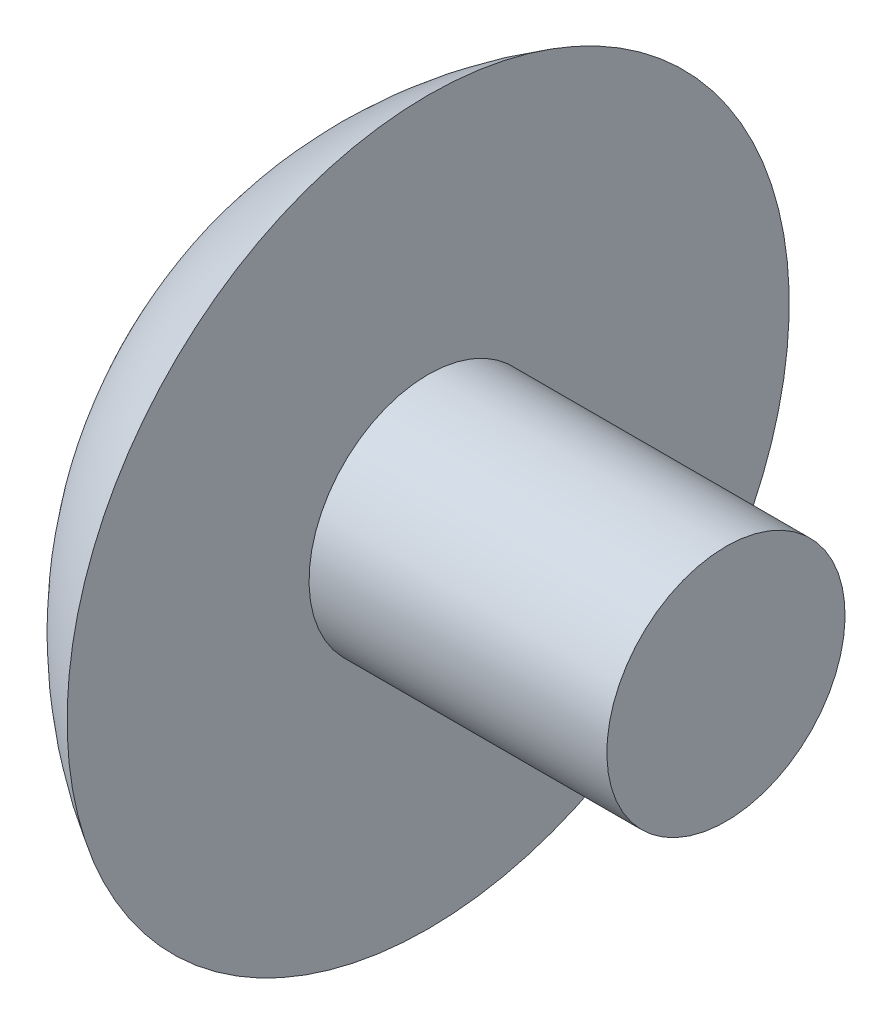
ISO-10303-21;
HEADER;
FILE_DESCRIPTION(('STEP AP214'),'2;1');
FILE_NAME('part.step','',(''),(''),'','','');
FILE_SCHEMA(('AUTOMOTIVE_DESIGN { 1 0 10303 214 1 1 1 1 }'));
ENDSEC;
DATA;
#1=APPLICATION_CONTEXT('core data for automotive mechanical design processes');
#2=APPLICATION_PROTOCOL_DEFINITION('international standard','automotive_design',2000,#1);
#3=PRODUCT_CONTEXT('',#1,'mechanical');
#4=PRODUCT('Part','Part','',(#3));
#5=PRODUCT_RELATED_PRODUCT_CATEGORY('part','',(#4));
#6=PRODUCT_DEFINITION_FORMATION('','',#4);
#7=PRODUCT_DEFINITION_CONTEXT('part definition',#1,'design');
#8=PRODUCT_DEFINITION('design','',#6,#7);
#9=PRODUCT_DEFINITION_SHAPE('','',#8);
#10=(LENGTH_UNIT() NAMED_UNIT(*) SI_UNIT(.MILLI.,.METRE.));
#11=(NAMED_UNIT(*) PLANE_ANGLE_UNIT() SI_UNIT($,.RADIAN.));
#12=(NAMED_UNIT(*) SI_UNIT($,.STERADIAN.) SOLID_ANGLE_UNIT());
#13=UNCERTAINTY_MEASURE_WITH_UNIT(LENGTH_MEASURE(1.E-05),#10,'distance_accuracy_value','');
#14=(GEOMETRIC_REPRESENTATION_CONTEXT(3) GLOBAL_UNCERTAINTY_ASSIGNED_CONTEXT((#13)) GLOBAL_UNIT_ASSIGNED_CONTEXT((#10,
#11,#12)) REPRESENTATION_CONTEXT('',''));
#15=CARTESIAN_POINT('',(0.,0.,0.));
#16=DIRECTION('',(0.,0.,1.));
#17=DIRECTION('',(1.,0.,0.));
#18=AXIS2_PLACEMENT_3D('',#15,#16,#17);
#19=CARTESIAN_POINT('',(0.,0.,0.));
#20=DIRECTION('',(-1.,0.,0.));
#21=DIRECTION('',(0.,-1.,0.));
#22=AXIS2_PLACEMENT_3D('',#19,#20,#21);
#23=PLANE('',#22);
#24=CARTESIAN_POINT('',(0.,0.,0.));
#25=DIRECTION('',(1.,0.,0.));
#26=DIRECTION('',(0.,1.,0.));
#27=AXIS2_PLACEMENT_3D('',#24,#25,#26);
#28=CIRCLE('',#27,2.);
#29=CARTESIAN_POINT('',(0.,2.,0.));
#30=VERTEX_POINT('',#29);
#31=EDGE_CURVE('E40',#30,#30,#28,.T.);
#32=ORIENTED_EDGE('',*,*,#31,.T.);
#33=EDGE_LOOP('',(#32));
#34=FACE_BOUND('',#33,.T.);
#35=ADVANCED_FACE('F30',(#34),#23,.F.);
#36=CARTESIAN_POINT('',(-1.5,0.,0.));
#37=DIRECTION('',(1.,0.,0.));
#38=DIRECTION('',(0.,-1.,0.));
#39=AXIS2_PLACEMENT_3D('',#36,#37,#38);
#40=SPHERICAL_SURFACE('',#39,7.);
#41=CARTESIAN_POINT('',(-5.,0.,0.));
#42=DIRECTION('',(1.,0.,0.));
#43=DIRECTION('',(0.,1.,0.));
#44=AXIS2_PLACEMENT_3D('',#41,#42,#43);
#45=CIRCLE('',#44,6.06217782649107);
#46=CARTESIAN_POINT('',(-5.00000000000001,6.06217782649107,0.));
#47=VERTEX_POINT('',#46);
#48=EDGE_CURVE('E10',#47,#47,#45,.T.);
#49=ORIENTED_EDGE('',*,*,#48,.F.);
#50=EDGE_LOOP('',(#49));
#51=FACE_BOUND('',#50,.T.);
#52=ADVANCED_FACE('F55',(#51),#40,.T.);
#53=CARTESIAN_POINT('',(-5.,-2.,0.));
#54=DIRECTION('',(-1.,0.,0.));
#55=DIRECTION('',(0.,-1.,0.));
#56=AXIS2_PLACEMENT_3D('',#53,#54,#55);
#57=PLANE('',#56);
#58=CARTESIAN_POINT('',(-5.,0.,0.));
#59=DIRECTION('',(1.,0.,0.));
#60=DIRECTION('',(0.,1.,0.));
#61=AXIS2_PLACEMENT_3D('',#58,#59,#60);
#62=CIRCLE('',#61,2.);
#63=CARTESIAN_POINT('',(-5.,2.,0.));
#64=VERTEX_POINT('',#63);
#65=EDGE_CURVE('E36',#64,#64,#62,.T.);
#66=ORIENTED_EDGE('',*,*,#65,.F.);
#67=EDGE_LOOP('',(#66));
#68=FACE_BOUND('',#67,.T.);
#69=ORIENTED_EDGE('',*,*,#48,.T.);
#70=EDGE_LOOP('',(#69));
#71=FACE_BOUND('',#70,.T.);
#72=ADVANCED_FACE('F50',(#68,#71),#57,.F.);
#73=CARTESIAN_POINT('',(0.,0.,0.));
#74=DIRECTION('',(1.,0.,0.));
#75=DIRECTION('',(0.,1.,0.));
#76=AXIS2_PLACEMENT_3D('',#73,#74,#75);
#77=CYLINDRICAL_SURFACE('',#76,2.);
#78=ORIENTED_EDGE('',*,*,#31,.F.);
#79=EDGE_LOOP('',(#78));
#80=FACE_BOUND('',#79,.T.);
#81=ORIENTED_EDGE('',*,*,#65,.T.);
#82=EDGE_LOOP('',(#81));
#83=FACE_BOUND('',#82,.T.);
#84=ADVANCED_FACE('F48',(#80,#83),#77,.T.);
#85=CLOSED_SHELL('',(#35,#52,#72,#84));
#86=MANIFOLD_SOLID_BREP('B2',#85);
#87=ADVANCED_BREP_SHAPE_REPRESENTATION('',(#18,#86),#14);
#88=SHAPE_DEFINITION_REPRESENTATION(#9,#87);
ENDSEC;
END-ISO-10303-21;
